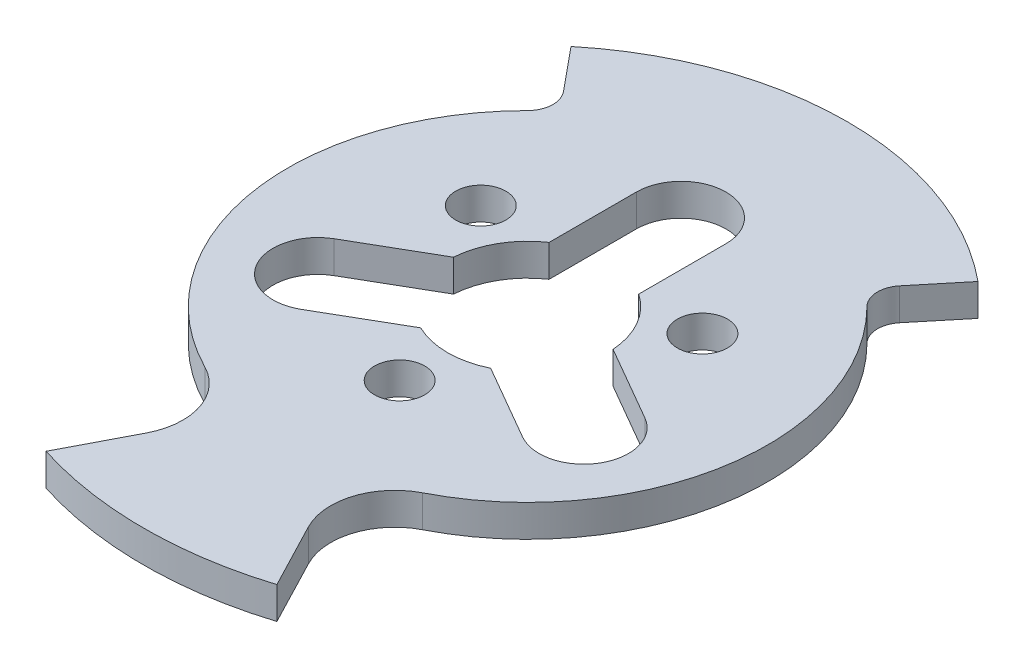
ISO-10303-21;
HEADER;
FILE_DESCRIPTION(('STEP AP214'),'2;1');
FILE_NAME('part.step','',(''),(''),'','','');
FILE_SCHEMA(('AUTOMOTIVE_DESIGN { 1 0 10303 214 1 1 1 1 }'));
ENDSEC;
DATA;
#1=APPLICATION_CONTEXT('core data for automotive mechanical design processes');
#2=APPLICATION_PROTOCOL_DEFINITION('international standard','automotive_design',2000,#1);
#3=PRODUCT_CONTEXT('',#1,'mechanical');
#4=PRODUCT('Part','Part','',(#3));
#5=PRODUCT_RELATED_PRODUCT_CATEGORY('part','',(#4));
#6=PRODUCT_DEFINITION_FORMATION('','',#4);
#7=PRODUCT_DEFINITION_CONTEXT('part definition',#1,'design');
#8=PRODUCT_DEFINITION('design','',#6,#7);
#9=PRODUCT_DEFINITION_SHAPE('','',#8);
#10=(LENGTH_UNIT() NAMED_UNIT(*) SI_UNIT(.MILLI.,.METRE.));
#11=(NAMED_UNIT(*) PLANE_ANGLE_UNIT() SI_UNIT($,.RADIAN.));
#12=(NAMED_UNIT(*) SI_UNIT($,.STERADIAN.) SOLID_ANGLE_UNIT());
#13=UNCERTAINTY_MEASURE_WITH_UNIT(LENGTH_MEASURE(1.E-05),#10,'distance_accuracy_value','');
#14=(GEOMETRIC_REPRESENTATION_CONTEXT(3) GLOBAL_UNCERTAINTY_ASSIGNED_CONTEXT((#13)) GLOBAL_UNIT_ASSIGNED_CONTEXT((#10,
#11,#12)) REPRESENTATION_CONTEXT('',''));
#15=CARTESIAN_POINT('',(0.,0.,0.));
#16=DIRECTION('',(0.,0.,1.));
#17=DIRECTION('',(1.,0.,0.));
#18=AXIS2_PLACEMENT_3D('',#15,#16,#17);
#19=CARTESIAN_POINT('',(0.,-38.1,0.));
#20=DIRECTION('',(0.,1.,0.));
#21=DIRECTION('',(0.,0.,1.));
#22=AXIS2_PLACEMENT_3D('',#19,#20,#21);
#23=CYLINDRICAL_SURFACE('',#22,23.8125);
#24=CARTESIAN_POINT('',(0.,-34.925,0.));
#25=DIRECTION('',(0.,-1.,0.));
#26=DIRECTION('',(0.,0.,-1.));
#27=AXIS2_PLACEMENT_3D('',#24,#25,#26);
#28=CIRCLE('',#27,23.8125);
#29=CARTESIAN_POINT('',(-10.8086921145059,-34.925,21.2180897119372));
#30=VERTEX_POINT('',#29);
#31=CARTESIAN_POINT('',(-16.8471089942339,-34.925,-16.8288465078984));
#32=VERTEX_POINT('',#31);
#33=EDGE_CURVE('E374',#30,#32,#28,.T.);
#34=ORIENTED_EDGE('',*,*,#33,.T.);
#35=DIRECTION('',(0.,1.,0.));
#36=VECTOR('',#35,1.);
#37=CARTESIAN_POINT('',(-16.8471089942339,-38.1,-16.8288465078984));
#38=LINE('',#37,#36);
#39=CARTESIAN_POINT('',(-16.8471089942339,-38.1,-16.8288465078984));
#40=VERTEX_POINT('',#39);
#41=EDGE_CURVE('E380',#32,#40,#38,.F.);
#42=ORIENTED_EDGE('',*,*,#41,.T.);
#43=CARTESIAN_POINT('',(0.,-38.1,0.));
#44=DIRECTION('',(0.,-1.,0.));
#45=DIRECTION('',(0.,0.,-1.));
#46=AXIS2_PLACEMENT_3D('',#43,#44,#45);
#47=CIRCLE('',#46,23.8125);
#48=CARTESIAN_POINT('',(-10.8086921145059,-38.1,21.2180897119372));
#49=VERTEX_POINT('',#48);
#50=EDGE_CURVE('E371',#49,#40,#47,.T.);
#51=ORIENTED_EDGE('',*,*,#50,.F.);
#52=DIRECTION('',(0.,-1.,0.));
#53=VECTOR('',#52,1.);
#54=CARTESIAN_POINT('',(-10.8086921145059,7.62308205651775,21.2180897119372));
#55=LINE('',#54,#53);
#56=EDGE_CURVE('E258',#30,#49,#55,.T.);
#57=ORIENTED_EDGE('',*,*,#56,.F.);
#58=EDGE_LOOP('',(#34,#42,#51,#57));
#59=FACE_BOUND('',#58,.T.);
#60=ADVANCED_FACE('F33',(#59),#23,.T.);
#61=CARTESIAN_POINT('',(0.,-38.1,0.));
#62=DIRECTION('',(0.,-1.,0.));
#63=DIRECTION('',(0.,0.,-1.));
#64=AXIS2_PLACEMENT_3D('',#61,#62,#63);
#65=PLANE('',#64);
#66=CARTESIAN_POINT('',(10.9985226280623,-38.1,-6.35000000000005));
#67=DIRECTION('',(0.,-1.,0.));
#68=DIRECTION('',(0.,0.,-1.));
#69=AXIS2_PLACEMENT_3D('',#66,#67,#68);
#70=CIRCLE('',#69,2.4892);
#71=CARTESIAN_POINT('',(10.9985226280623,-38.1,-8.83920000000005));
#72=VERTEX_POINT('',#71);
#73=EDGE_CURVE('E272',#72,#72,#70,.T.);
#74=ORIENTED_EDGE('',*,*,#73,.F.);
#75=EDGE_LOOP('',(#74));
#76=FACE_BOUND('',#75,.T.);
#77=DIRECTION('',(0.,0.,-1.));
#78=VECTOR('',#77,1.);
#79=CARTESIAN_POINT('',(-4.44500000000011,-38.1,-15.24));
#80=LINE('',#79,#78);
#81=CARTESIAN_POINT('',(-4.44500000000005,-38.1,-6.5761600687635));
#82=VERTEX_POINT('',#81);
#83=CARTESIAN_POINT('',(-4.44500000000011,-38.1,-15.24));
#84=VERTEX_POINT('',#83);
#85=EDGE_CURVE('E286',#82,#84,#80,.T.);
#86=ORIENTED_EDGE('',*,*,#85,.F.);
#87=CARTESIAN_POINT('',(0.,-38.1,0.));
#88=DIRECTION('',(0.,-1.,0.));
#89=DIRECTION('',(0.,0.,-1.));
#90=AXIS2_PLACEMENT_3D('',#87,#88,#89);
#91=CIRCLE('',#90,7.9375);
#92=CARTESIAN_POINT('',(-7.91762167890205,-38.1,-0.561402885439971));
#93=VERTEX_POINT('',#92);
#94=EDGE_CURVE('E284',#93,#82,#91,.T.);
#95=ORIENTED_EDGE('',*,*,#94,.F.);
#96=DIRECTION('',(0.866025403784433,0.,-0.50000000000001));
#97=VECTOR('',#96,1.);
#98=CARTESIAN_POINT('',(-7.91762167890205,-38.1,-0.561402885439971));
#99=LINE('',#98,#97);
#100=CARTESIAN_POINT('',(-15.4207271536748,-38.1,3.77051708017835));
#101=VERTEX_POINT('',#100);
#102=EDGE_CURVE('E308',#101,#93,#99,.T.);
#103=ORIENTED_EDGE('',*,*,#102,.F.);
#104=CARTESIAN_POINT('',(-13.1982271536748,-38.1,7.62000000000015));
#105=DIRECTION('',(0.,-1.,0.));
#106=DIRECTION('',(0.,0.,-1.));
#107=AXIS2_PLACEMENT_3D('',#104,#105,#106);
#108=CIRCLE('',#107,4.445);
#109=CARTESIAN_POINT('',(-10.9757271536747,-38.1,11.469482919822));
#110=VERTEX_POINT('',#109);
#111=EDGE_CURVE('E305',#110,#101,#108,.T.);
#112=ORIENTED_EDGE('',*,*,#111,.F.);
#113=DIRECTION('',(-0.866025403784433,0.,0.50000000000001));
#114=VECTOR('',#113,1.);
#115=CARTESIAN_POINT('',(-10.9757271536747,-38.1,11.469482919822));
#116=LINE('',#115,#114);
#117=CARTESIAN_POINT('',(-3.47262167890196,-38.1,7.13756295420364));
#118=VERTEX_POINT('',#117);
#119=EDGE_CURVE('E303',#118,#110,#116,.T.);
#120=ORIENTED_EDGE('',*,*,#119,.F.);
#121=CARTESIAN_POINT('',(0.,-38.1,0.));
#122=DIRECTION('',(0.,-1.,0.));
#123=DIRECTION('',(0.,0.,-1.));
#124=AXIS2_PLACEMENT_3D('',#121,#122,#123);
#125=CIRCLE('',#124,7.9375);
#126=CARTESIAN_POINT('',(3.47262167890206,-38.1,7.13756295420359));
#127=VERTEX_POINT('',#126);
#128=EDGE_CURVE('E301',#127,#118,#125,.T.);
#129=ORIENTED_EDGE('',*,*,#128,.F.);
#130=DIRECTION('',(-0.86602540378444,0.,-0.499999999999998));
#131=VECTOR('',#130,1.);
#132=CARTESIAN_POINT('',(3.47262167890206,-38.1,7.13756295420359));
#133=LINE('',#132,#131);
#134=CARTESIAN_POINT('',(10.9757271536749,-38.1,11.4694829198218));
#135=VERTEX_POINT('',#134);
#136=EDGE_CURVE('E299',#135,#127,#133,.T.);
#137=ORIENTED_EDGE('',*,*,#136,.F.);
#138=CARTESIAN_POINT('',(13.1982271536749,-38.1,7.61999999999997));
#139=DIRECTION('',(0.,-1.,0.));
#140=DIRECTION('',(0.,0.,-1.));
#141=AXIS2_PLACEMENT_3D('',#138,#139,#140);
#142=CIRCLE('',#141,4.445);
#143=CARTESIAN_POINT('',(15.4207271536749,-38.1,3.77051708017813));
#144=VERTEX_POINT('',#143);
#145=EDGE_CURVE('E297',#144,#135,#142,.T.);
#146=ORIENTED_EDGE('',*,*,#145,.F.);
#147=DIRECTION('',(0.86602540378444,0.,0.499999999999998));
#148=VECTOR('',#147,1.);
#149=CARTESIAN_POINT('',(15.4207271536749,-38.1,3.77051708017813));
#150=LINE('',#149,#148);
#151=CARTESIAN_POINT('',(7.91762167890204,-38.1,-0.561402885440083));
#152=VERTEX_POINT('',#151);
#153=EDGE_CURVE('E295',#152,#144,#150,.T.);
#154=ORIENTED_EDGE('',*,*,#153,.F.);
#155=CARTESIAN_POINT('',(0.,-38.1,0.));
#156=DIRECTION('',(0.,-1.,0.));
#157=DIRECTION('',(0.,0.,-1.));
#158=AXIS2_PLACEMENT_3D('',#155,#156,#157);
#159=CIRCLE('',#158,7.9375);
#160=CARTESIAN_POINT('',(4.44499999999995,-38.1,-6.57616006876356));
#161=VERTEX_POINT('',#160);
#162=EDGE_CURVE('E293',#161,#152,#159,.T.);
#163=ORIENTED_EDGE('',*,*,#162,.F.);
#164=DIRECTION('',(0.,0.,1.));
#165=VECTOR('',#164,1.);
#166=CARTESIAN_POINT('',(4.44499999999995,-38.1,-6.57616006876356));
#167=LINE('',#166,#165);
#168=CARTESIAN_POINT('',(4.4449999999999,-38.1,-15.24));
#169=VERTEX_POINT('',#168);
#170=EDGE_CURVE('E291',#169,#161,#167,.T.);
#171=ORIENTED_EDGE('',*,*,#170,.F.);
#172=CARTESIAN_POINT('',(-1.04950770296597E-13,-38.1,-15.24));
#173=DIRECTION('',(0.,-1.,0.));
#174=DIRECTION('',(0.,0.,-1.));
#175=AXIS2_PLACEMENT_3D('',#172,#173,#174);
#176=CIRCLE('',#175,4.445);
#177=EDGE_CURVE('E289',#84,#169,#176,.T.);
#178=ORIENTED_EDGE('',*,*,#177,.F.);
#179=EDGE_LOOP('',(#86,#95,#103,#112,#120,#129,#137,#146,#154,#163,#171,#178));
#180=FACE_BOUND('',#179,.T.);
#181=ORIENTED_EDGE('',*,*,#50,.T.);
#182=CARTESIAN_POINT('',(-18.6441339536189,-38.1,-18.6239234687408));
#183=DIRECTION('',(0.,-1.,0.));
#184=DIRECTION('',(0.,0.,-1.));
#185=AXIS2_PLACEMENT_3D('',#182,#183,#184);
#186=CIRCLE('',#185,2.54);
#187=CARTESIAN_POINT('',(-16.6842075118141,-38.1,-20.2395621482464));
#188=VERTEX_POINT('',#187);
#189=EDGE_CURVE('E41',#40,#188,#186,.F.);
#190=ORIENTED_EDGE('',*,*,#189,.T.);
#191=DIRECTION('',(-0.636078220277765,0.,-0.771624583387719));
#192=VECTOR('',#191,1.);
#193=CARTESIAN_POINT('',(-20.195483493819,-38.1,-24.4990805225601));
#194=LINE('',#193,#192);
#195=CARTESIAN_POINT('',(-20.195483493819,-38.1,-24.4990805225601));
#196=VERTEX_POINT('',#195);
#197=EDGE_CURVE('E204',#188,#196,#194,.T.);
#198=ORIENTED_EDGE('',*,*,#197,.T.);
#199=CARTESIAN_POINT('',(0.,-38.1,0.));
#200=DIRECTION('',(0.,-1.,0.));
#201=DIRECTION('',(0.,0.,-1.));
#202=AXIS2_PLACEMENT_3D('',#199,#200,#201);
#203=CIRCLE('',#202,31.75);
#204=CARTESIAN_POINT('',(20.195483493819,-38.1,-24.4990805225601));
#205=VERTEX_POINT('',#204);
#206=EDGE_CURVE('E199',#196,#205,#203,.T.);
#207=ORIENTED_EDGE('',*,*,#206,.T.);
#208=DIRECTION('',(-0.636078220277765,0.,0.771624583387719));
#209=VECTOR('',#208,1.);
#210=CARTESIAN_POINT('',(20.195483493819,-38.1,-24.4990805225601));
#211=LINE('',#210,#209);
#212=CARTESIAN_POINT('',(16.6842075118141,-38.1,-20.2395621482464));
#213=VERTEX_POINT('',#212);
#214=EDGE_CURVE('E208',#205,#213,#211,.T.);
#215=ORIENTED_EDGE('',*,*,#214,.T.);
#216=CARTESIAN_POINT('',(18.6441339536189,-38.1,-18.6239234687408));
#217=DIRECTION('',(0.,-1.,0.));
#218=DIRECTION('',(0.,0.,-1.));
#219=AXIS2_PLACEMENT_3D('',#216,#217,#218);
#220=CIRCLE('',#219,2.54);
#221=CARTESIAN_POINT('',(16.8471089942339,-38.1,-16.8288465078984));
#222=VERTEX_POINT('',#221);
#223=EDGE_CURVE('E384',#213,#222,#220,.F.);
#224=ORIENTED_EDGE('',*,*,#223,.T.);
#225=CARTESIAN_POINT('',(10.8086921145059,-38.1,21.2180897119372));
#226=VERTEX_POINT('',#225);
#227=EDGE_CURVE('E373',#222,#226,#47,.T.);
#228=ORIENTED_EDGE('',*,*,#227,.T.);
#229=CARTESIAN_POINT('',(13.6910100117075,-38.1,26.8762469684538));
#230=DIRECTION('',(0.,1.,0.));
#231=DIRECTION('',(0.,0.,-1.));
#232=AXIS2_PLACEMENT_3D('',#229,#230,#231);
#233=CIRCLE('',#232,6.35);
#234=CARTESIAN_POINT('',(8.05849122102583,-38.1,29.8083506624963));
#235=VERTEX_POINT('',#234);
#236=EDGE_CURVE('E245',#226,#235,#233,.T.);
#237=ORIENTED_EDGE('',*,*,#236,.T.);
#238=DIRECTION('',(0.461748613235035,0.,0.887010833178221));
#239=VECTOR('',#238,1.);
#240=CARTESIAN_POINT('',(11.4568909611131,-38.1,36.3366158235074));
#241=LINE('',#240,#239);
#242=CARTESIAN_POINT('',(11.4568909611131,-38.1,36.3366158235074));
#243=VERTEX_POINT('',#242);
#244=EDGE_CURVE('E248',#235,#243,#241,.T.);
#245=ORIENTED_EDGE('',*,*,#244,.T.);
#246=CARTESIAN_POINT('',(0.,-38.1,0.));
#247=DIRECTION('',(0.,-1.,0.));
#248=DIRECTION('',(0.,0.,1.));
#249=AXIS2_PLACEMENT_3D('',#246,#247,#248);
#250=CIRCLE('',#249,38.1);
#251=CARTESIAN_POINT('',(-11.4568909611131,-38.1,36.3366158235074));
#252=VERTEX_POINT('',#251);
#253=EDGE_CURVE('E225',#243,#252,#250,.T.);
#254=ORIENTED_EDGE('',*,*,#253,.T.);
#255=DIRECTION('',(0.461748613235035,0.,-0.887010833178221));
#256=VECTOR('',#255,1.);
#257=CARTESIAN_POINT('',(-11.4568909611131,-38.1,36.3366158235074));
#258=LINE('',#257,#256);
#259=CARTESIAN_POINT('',(-8.05849122102583,-38.1,29.8083506624963));
#260=VERTEX_POINT('',#259);
#261=EDGE_CURVE('E239',#252,#260,#258,.T.);
#262=ORIENTED_EDGE('',*,*,#261,.T.);
#263=CARTESIAN_POINT('',(-13.6910100117075,-38.1,26.8762469684538));
#264=DIRECTION('',(0.,1.,0.));
#265=DIRECTION('',(0.,0.,1.));
#266=AXIS2_PLACEMENT_3D('',#263,#264,#265);
#267=CIRCLE('',#266,6.35);
#268=EDGE_CURVE('E242',#260,#49,#267,.T.);
#269=ORIENTED_EDGE('',*,*,#268,.T.);
#270=EDGE_LOOP('',(#181,#190,#198,#207,#215,#224,#228,#237,#245,#254,#262,#269));
#271=FACE_BOUND('',#270,.T.);
#272=CARTESIAN_POINT('',(0.,-38.1,12.7));
#273=DIRECTION('',(0.,-1.,0.));
#274=DIRECTION('',(0.,0.,-1.));
#275=AXIS2_PLACEMENT_3D('',#272,#273,#274);
#276=CIRCLE('',#275,2.4892);
#277=CARTESIAN_POINT('',(0.,-38.1,10.2108));
#278=VERTEX_POINT('',#277);
#279=EDGE_CURVE('E278',#278,#278,#276,.T.);
#280=ORIENTED_EDGE('',*,*,#279,.F.);
#281=EDGE_LOOP('',(#280));
#282=FACE_BOUND('',#281,.T.);
#283=CARTESIAN_POINT('',(-10.9985226280624,-38.1,-6.3499999999999));
#284=DIRECTION('',(0.,-1.,0.));
#285=DIRECTION('',(0.,0.,-1.));
#286=AXIS2_PLACEMENT_3D('',#283,#284,#285);
#287=CIRCLE('',#286,2.4892);
#288=CARTESIAN_POINT('',(-10.9985226280624,-38.1,-8.8391999999999));
#289=VERTEX_POINT('',#288);
#290=EDGE_CURVE('E266',#289,#289,#287,.T.);
#291=ORIENTED_EDGE('',*,*,#290,.F.);
#292=EDGE_LOOP('',(#291));
#293=FACE_BOUND('',#292,.T.);
#294=ADVANCED_FACE('F213',(#76,#180,#271,#282,#293),#65,.T.);
#295=CARTESIAN_POINT('',(0.,-34.925,0.));
#296=DIRECTION('',(0.,-1.,0.));
#297=DIRECTION('',(0.,0.,-1.));
#298=AXIS2_PLACEMENT_3D('',#295,#296,#297);
#299=PLANE('',#298);
#300=ORIENTED_EDGE('',*,*,#33,.F.);
#301=CARTESIAN_POINT('',(-13.6910100117075,-34.925,26.8762469684538));
#302=DIRECTION('',(0.,-1.,0.));
#303=DIRECTION('',(0.,0.,-1.));
#304=AXIS2_PLACEMENT_3D('',#301,#302,#303);
#305=CIRCLE('',#304,6.35);
#306=CARTESIAN_POINT('',(-8.05849122102583,-34.925,29.8083506624963));
#307=VERTEX_POINT('',#306);
#308=EDGE_CURVE('E226',#30,#307,#305,.T.);
#309=ORIENTED_EDGE('',*,*,#308,.T.);
#310=DIRECTION('',(-0.461748613235035,0.,0.887010833178221));
#311=VECTOR('',#310,1.);
#312=CARTESIAN_POINT('',(-11.4568909611131,-34.925,36.3366158235074));
#313=LINE('',#312,#311);
#314=CARTESIAN_POINT('',(-11.4568909611131,-34.925,36.3366158235074));
#315=VERTEX_POINT('',#314);
#316=EDGE_CURVE('E236',#307,#315,#313,.T.);
#317=ORIENTED_EDGE('',*,*,#316,.T.);
#318=CARTESIAN_POINT('',(0.,-34.925,0.));
#319=DIRECTION('',(0.,-1.,0.));
#320=DIRECTION('',(0.,0.,-1.));
#321=AXIS2_PLACEMENT_3D('',#318,#319,#320);
#322=CIRCLE('',#321,38.1);
#323=CARTESIAN_POINT('',(11.4568909611131,-34.925,36.3366158235074));
#324=VERTEX_POINT('',#323);
#325=EDGE_CURVE('E234',#315,#324,#322,.F.);
#326=ORIENTED_EDGE('',*,*,#325,.T.);
#327=DIRECTION('',(-0.461748613235035,0.,-0.887010833178221));
#328=VECTOR('',#327,1.);
#329=CARTESIAN_POINT('',(11.4568909611131,-34.925,36.3366158235074));
#330=LINE('',#329,#328);
#331=CARTESIAN_POINT('',(8.05849122102582,-34.925,29.8083506624963));
#332=VERTEX_POINT('',#331);
#333=EDGE_CURVE('E232',#324,#332,#330,.T.);
#334=ORIENTED_EDGE('',*,*,#333,.T.);
#335=CARTESIAN_POINT('',(13.6910100117075,-34.925,26.8762469684538));
#336=DIRECTION('',(0.,-1.,0.));
#337=DIRECTION('',(0.,0.,-1.));
#338=AXIS2_PLACEMENT_3D('',#335,#336,#337);
#339=CIRCLE('',#338,6.35);
#340=CARTESIAN_POINT('',(10.8086921145059,-34.925,21.2180897119372));
#341=VERTEX_POINT('',#340);
#342=EDGE_CURVE('E228',#332,#341,#339,.T.);
#343=ORIENTED_EDGE('',*,*,#342,.T.);
#344=CARTESIAN_POINT('',(16.8471089942339,-34.925,-16.8288465078984));
#345=VERTEX_POINT('',#344);
#346=EDGE_CURVE('E370',#345,#341,#28,.T.);
#347=ORIENTED_EDGE('',*,*,#346,.F.);
#348=CARTESIAN_POINT('',(18.6441339536189,-34.925,-18.6239234687408));
#349=DIRECTION('',(0.,-1.,0.));
#350=DIRECTION('',(0.,0.,-1.));
#351=AXIS2_PLACEMENT_3D('',#348,#349,#350);
#352=CIRCLE('',#351,2.54);
#353=CARTESIAN_POINT('',(16.6842075118141,-34.925,-20.2395621482464));
#354=VERTEX_POINT('',#353);
#355=EDGE_CURVE('E386',#345,#354,#352,.T.);
#356=ORIENTED_EDGE('',*,*,#355,.T.);
#357=DIRECTION('',(0.636078220277765,0.,-0.77162458338772));
#358=VECTOR('',#357,1.);
#359=CARTESIAN_POINT('',(20.195483493819,-34.925,-24.4990805225601));
#360=LINE('',#359,#358);
#361=CARTESIAN_POINT('',(20.195483493819,-34.925,-24.4990805225601));
#362=VERTEX_POINT('',#361);
#363=EDGE_CURVE('E223',#354,#362,#360,.T.);
#364=ORIENTED_EDGE('',*,*,#363,.T.);
#365=CARTESIAN_POINT('',(0.,-34.925,0.));
#366=DIRECTION('',(0.,-1.,0.));
#367=DIRECTION('',(0.,0.,-1.));
#368=AXIS2_PLACEMENT_3D('',#365,#366,#367);
#369=CIRCLE('',#368,31.75);
#370=CARTESIAN_POINT('',(-20.195483493819,-34.925,-24.4990805225601));
#371=VERTEX_POINT('',#370);
#372=EDGE_CURVE('E200',#362,#371,#369,.F.);
#373=ORIENTED_EDGE('',*,*,#372,.T.);
#374=DIRECTION('',(0.636078220277765,0.,0.77162458338772));
#375=VECTOR('',#374,1.);
#376=CARTESIAN_POINT('',(-20.195483493819,-34.925,-24.4990805225601));
#377=LINE('',#376,#375);
#378=CARTESIAN_POINT('',(-16.6842075118141,-34.925,-20.2395621482464));
#379=VERTEX_POINT('',#378);
#380=EDGE_CURVE('E221',#371,#379,#377,.T.);
#381=ORIENTED_EDGE('',*,*,#380,.T.);
#382=CARTESIAN_POINT('',(-18.6441339536189,-34.925,-18.6239234687408));
#383=DIRECTION('',(0.,-1.,0.));
#384=DIRECTION('',(0.,0.,-1.));
#385=AXIS2_PLACEMENT_3D('',#382,#383,#384);
#386=CIRCLE('',#385,2.54);
#387=EDGE_CURVE('E11',#379,#32,#386,.T.);
#388=ORIENTED_EDGE('',*,*,#387,.T.);
#389=EDGE_LOOP('',(#300,#309,#317,#326,#334,#343,#347,#356,#364,#373,#381,#388));
#390=FACE_BOUND('',#389,.T.);
#391=CARTESIAN_POINT('',(0.,-34.925,0.));
#392=DIRECTION('',(0.,-1.,0.));
#393=DIRECTION('',(0.,0.,-1.));
#394=AXIS2_PLACEMENT_3D('',#391,#392,#393);
#395=CIRCLE('',#394,7.9375);
#396=CARTESIAN_POINT('',(-7.91762167890205,-34.925,-0.561402885439971));
#397=VERTEX_POINT('',#396);
#398=CARTESIAN_POINT('',(-4.44500000000005,-34.925,-6.5761600687635));
#399=VERTEX_POINT('',#398);
#400=EDGE_CURVE('E281',#397,#399,#395,.T.);
#401=ORIENTED_EDGE('',*,*,#400,.T.);
#402=DIRECTION('',(0.,0.,-1.));
#403=VECTOR('',#402,1.);
#404=CARTESIAN_POINT('',(-4.44500000000011,-34.925,-15.24));
#405=LINE('',#404,#403);
#406=CARTESIAN_POINT('',(-4.44500000000011,-34.925,-15.24));
#407=VERTEX_POINT('',#406);
#408=EDGE_CURVE('E313',#399,#407,#405,.T.);
#409=ORIENTED_EDGE('',*,*,#408,.T.);
#410=CARTESIAN_POINT('',(-1.04950770296597E-13,-34.925,-15.24));
#411=DIRECTION('',(0.,-1.,0.));
#412=DIRECTION('',(0.,0.,-1.));
#413=AXIS2_PLACEMENT_3D('',#410,#411,#412);
#414=CIRCLE('',#413,4.445);
#415=CARTESIAN_POINT('',(4.4449999999999,-34.925,-15.24));
#416=VERTEX_POINT('',#415);
#417=EDGE_CURVE('E316',#407,#416,#414,.T.);
#418=ORIENTED_EDGE('',*,*,#417,.T.);
#419=DIRECTION('',(0.,0.,1.));
#420=VECTOR('',#419,1.);
#421=CARTESIAN_POINT('',(4.44499999999995,-34.925,-6.57616006876356));
#422=LINE('',#421,#420);
#423=CARTESIAN_POINT('',(4.44499999999995,-34.925,-6.57616006876356));
#424=VERTEX_POINT('',#423);
#425=EDGE_CURVE('E319',#416,#424,#422,.T.);
#426=ORIENTED_EDGE('',*,*,#425,.T.);
#427=CARTESIAN_POINT('',(0.,-34.925,0.));
#428=DIRECTION('',(0.,-1.,0.));
#429=DIRECTION('',(0.,0.,-1.));
#430=AXIS2_PLACEMENT_3D('',#427,#428,#429);
#431=CIRCLE('',#430,7.9375);
#432=CARTESIAN_POINT('',(7.91762167890204,-34.925,-0.561402885440083));
#433=VERTEX_POINT('',#432);
#434=EDGE_CURVE('E322',#424,#433,#431,.T.);
#435=ORIENTED_EDGE('',*,*,#434,.T.);
#436=DIRECTION('',(0.86602540378444,0.,0.499999999999998));
#437=VECTOR('',#436,1.);
#438=CARTESIAN_POINT('',(15.4207271536749,-34.925,3.77051708017813));
#439=LINE('',#438,#437);
#440=CARTESIAN_POINT('',(15.4207271536749,-34.925,3.77051708017813));
#441=VERTEX_POINT('',#440);
#442=EDGE_CURVE('E325',#433,#441,#439,.T.);
#443=ORIENTED_EDGE('',*,*,#442,.T.);
#444=CARTESIAN_POINT('',(13.1982271536749,-34.925,7.61999999999997));
#445=DIRECTION('',(0.,-1.,0.));
#446=DIRECTION('',(0.,0.,-1.));
#447=AXIS2_PLACEMENT_3D('',#444,#445,#446);
#448=CIRCLE('',#447,4.445);
#449=CARTESIAN_POINT('',(10.9757271536749,-34.925,11.4694829198218));
#450=VERTEX_POINT('',#449);
#451=EDGE_CURVE('E328',#441,#450,#448,.T.);
#452=ORIENTED_EDGE('',*,*,#451,.T.);
#453=DIRECTION('',(-0.86602540378444,0.,-0.499999999999998));
#454=VECTOR('',#453,1.);
#455=CARTESIAN_POINT('',(3.47262167890206,-34.925,7.13756295420359));
#456=LINE('',#455,#454);
#457=CARTESIAN_POINT('',(3.47262167890206,-34.925,7.13756295420359));
#458=VERTEX_POINT('',#457);
#459=EDGE_CURVE('E331',#450,#458,#456,.T.);
#460=ORIENTED_EDGE('',*,*,#459,.T.);
#461=CARTESIAN_POINT('',(0.,-34.925,0.));
#462=DIRECTION('',(0.,-1.,0.));
#463=DIRECTION('',(0.,0.,-1.));
#464=AXIS2_PLACEMENT_3D('',#461,#462,#463);
#465=CIRCLE('',#464,7.9375);
#466=CARTESIAN_POINT('',(-3.47262167890196,-34.925,7.13756295420364));
#467=VERTEX_POINT('',#466);
#468=EDGE_CURVE('E334',#458,#467,#465,.T.);
#469=ORIENTED_EDGE('',*,*,#468,.T.);
#470=DIRECTION('',(-0.866025403784433,0.,0.50000000000001));
#471=VECTOR('',#470,1.);
#472=CARTESIAN_POINT('',(-10.9757271536747,-34.925,11.469482919822));
#473=LINE('',#472,#471);
#474=CARTESIAN_POINT('',(-10.9757271536747,-34.925,11.469482919822));
#475=VERTEX_POINT('',#474);
#476=EDGE_CURVE('E337',#467,#475,#473,.T.);
#477=ORIENTED_EDGE('',*,*,#476,.T.);
#478=CARTESIAN_POINT('',(-13.1982271536748,-34.925,7.62000000000015));
#479=DIRECTION('',(0.,-1.,0.));
#480=DIRECTION('',(0.,0.,-1.));
#481=AXIS2_PLACEMENT_3D('',#478,#479,#480);
#482=CIRCLE('',#481,4.445);
#483=CARTESIAN_POINT('',(-15.4207271536748,-34.925,3.77051708017835));
#484=VERTEX_POINT('',#483);
#485=EDGE_CURVE('E340',#475,#484,#482,.T.);
#486=ORIENTED_EDGE('',*,*,#485,.T.);
#487=DIRECTION('',(0.866025403784433,0.,-0.50000000000001));
#488=VECTOR('',#487,1.);
#489=CARTESIAN_POINT('',(-7.91762167890205,-34.925,-0.561402885439971));
#490=LINE('',#489,#488);
#491=EDGE_CURVE('E287',#484,#397,#490,.T.);
#492=ORIENTED_EDGE('',*,*,#491,.T.);
#493=EDGE_LOOP('',(#401,#409,#418,#426,#435,#443,#452,#460,#469,#477,#486,#492));
#494=FACE_BOUND('',#493,.T.);
#495=CARTESIAN_POINT('',(0.,-34.925,12.7));
#496=DIRECTION('',(0.,-1.,0.));
#497=DIRECTION('',(0.,0.,-1.));
#498=AXIS2_PLACEMENT_3D('',#495,#496,#497);
#499=CIRCLE('',#498,2.4892);
#500=CARTESIAN_POINT('',(0.,-34.925,10.2108));
#501=VERTEX_POINT('',#500);
#502=EDGE_CURVE('E275',#501,#501,#499,.T.);
#503=ORIENTED_EDGE('',*,*,#502,.T.);
#504=EDGE_LOOP('',(#503));
#505=FACE_BOUND('',#504,.T.);
#506=CARTESIAN_POINT('',(10.9985226280623,-34.925,-6.35000000000005));
#507=DIRECTION('',(0.,-1.,0.));
#508=DIRECTION('',(0.,0.,-1.));
#509=AXIS2_PLACEMENT_3D('',#506,#507,#508);
#510=CIRCLE('',#509,2.4892);
#511=CARTESIAN_POINT('',(10.9985226280623,-34.925,-8.83920000000005));
#512=VERTEX_POINT('',#511);
#513=EDGE_CURVE('E269',#512,#512,#510,.T.);
#514=ORIENTED_EDGE('',*,*,#513,.T.);
#515=EDGE_LOOP('',(#514));
#516=FACE_BOUND('',#515,.T.);
#517=CARTESIAN_POINT('',(-10.9985226280624,-34.925,-6.3499999999999));
#518=DIRECTION('',(0.,-1.,0.));
#519=DIRECTION('',(0.,0.,-1.));
#520=AXIS2_PLACEMENT_3D('',#517,#518,#519);
#521=CIRCLE('',#520,2.4892);
#522=CARTESIAN_POINT('',(-10.9985226280624,-34.925,-8.8391999999999));
#523=VERTEX_POINT('',#522);
#524=EDGE_CURVE('E265',#523,#523,#521,.T.);
#525=ORIENTED_EDGE('',*,*,#524,.T.);
#526=EDGE_LOOP('',(#525));
#527=FACE_BOUND('',#526,.T.);
#528=ADVANCED_FACE('F390',(#390,#494,#505,#516,#527),#299,.F.);
#529=ORIENTED_EDGE('',*,*,#227,.F.);
#530=DIRECTION('',(0.,1.,0.));
#531=VECTOR('',#530,1.);
#532=CARTESIAN_POINT('',(16.8471089942339,-38.1,-16.8288465078984));
#533=LINE('',#532,#531);
#534=EDGE_CURVE('E378',#222,#345,#533,.T.);
#535=ORIENTED_EDGE('',*,*,#534,.T.);
#536=ORIENTED_EDGE('',*,*,#346,.T.);
#537=DIRECTION('',(0.,-1.,0.));
#538=VECTOR('',#537,1.);
#539=CARTESIAN_POINT('',(10.8086921145059,7.62308205651775,21.2180897119372));
#540=LINE('',#539,#538);
#541=EDGE_CURVE('E255',#341,#226,#540,.T.);
#542=ORIENTED_EDGE('',*,*,#541,.T.);
#543=EDGE_LOOP('',(#529,#535,#536,#542));
#544=FACE_BOUND('',#543,.T.);
#545=ADVANCED_FACE('F397',(#544),#23,.T.);
#546=CARTESIAN_POINT('',(0.,-38.1,0.));
#547=DIRECTION('',(0.,1.,0.));
#548=DIRECTION('',(0.,0.,1.));
#549=AXIS2_PLACEMENT_3D('',#546,#547,#548);
#550=CYLINDRICAL_SURFACE('',#549,7.9375);
#551=ORIENTED_EDGE('',*,*,#400,.F.);
#552=DIRECTION('',(0.,1.,0.));
#553=VECTOR('',#552,1.);
#554=CARTESIAN_POINT('',(-7.91762167890205,-38.1,-0.561402885439971));
#555=LINE('',#554,#553);
#556=EDGE_CURVE('E310',#93,#397,#555,.T.);
#557=ORIENTED_EDGE('',*,*,#556,.F.);
#558=ORIENTED_EDGE('',*,*,#94,.T.);
#559=DIRECTION('',(0.,1.,0.));
#560=VECTOR('',#559,1.);
#561=CARTESIAN_POINT('',(-4.44500000000005,-38.1,-6.5761600687635));
#562=LINE('',#561,#560);
#563=EDGE_CURVE('E368',#82,#399,#562,.T.);
#564=ORIENTED_EDGE('',*,*,#563,.T.);
#565=EDGE_LOOP('',(#551,#557,#558,#564));
#566=FACE_BOUND('',#565,.T.);
#567=ADVANCED_FACE('F446',(#566),#550,.F.);
#568=CARTESIAN_POINT('',(-4.44500000000011,-38.1,-15.24));
#569=DIRECTION('',(1.,0.,0.));
#570=DIRECTION('',(0.,0.,-1.));
#571=AXIS2_PLACEMENT_3D('',#568,#569,#570);
#572=PLANE('',#571);
#573=ORIENTED_EDGE('',*,*,#408,.F.);
#574=ORIENTED_EDGE('',*,*,#563,.F.);
#575=ORIENTED_EDGE('',*,*,#85,.T.);
#576=DIRECTION('',(0.,1.,0.));
#577=VECTOR('',#576,1.);
#578=CARTESIAN_POINT('',(-4.44500000000011,-38.1,-15.24));
#579=LINE('',#578,#577);
#580=EDGE_CURVE('E366',#84,#407,#579,.T.);
#581=ORIENTED_EDGE('',*,*,#580,.T.);
#582=EDGE_LOOP('',(#573,#574,#575,#581));
#583=FACE_BOUND('',#582,.T.);
#584=ADVANCED_FACE('F451',(#583),#572,.T.);
#585=CARTESIAN_POINT('',(-1.04950770296597E-13,-38.1,-15.24));
#586=DIRECTION('',(0.,1.,0.));
#587=DIRECTION('',(0.,0.,1.));
#588=AXIS2_PLACEMENT_3D('',#585,#586,#587);
#589=CYLINDRICAL_SURFACE('',#588,4.445);
#590=ORIENTED_EDGE('',*,*,#417,.F.);
#591=ORIENTED_EDGE('',*,*,#580,.F.);
#592=ORIENTED_EDGE('',*,*,#177,.T.);
#593=DIRECTION('',(0.,1.,0.));
#594=VECTOR('',#593,1.);
#595=CARTESIAN_POINT('',(4.4449999999999,-38.1,-15.24));
#596=LINE('',#595,#594);
#597=EDGE_CURVE('E364',#169,#416,#596,.T.);
#598=ORIENTED_EDGE('',*,*,#597,.T.);
#599=EDGE_LOOP('',(#590,#591,#592,#598));
#600=FACE_BOUND('',#599,.T.);
#601=ADVANCED_FACE('F459',(#600),#589,.F.);
#602=CARTESIAN_POINT('',(4.44499999999995,-38.1,-6.57616006876356));
#603=DIRECTION('',(-1.,0.,0.));
#604=DIRECTION('',(0.,0.,1.));
#605=AXIS2_PLACEMENT_3D('',#602,#603,#604);
#606=PLANE('',#605);
#607=ORIENTED_EDGE('',*,*,#425,.F.);
#608=ORIENTED_EDGE('',*,*,#597,.F.);
#609=ORIENTED_EDGE('',*,*,#170,.T.);
#610=DIRECTION('',(0.,1.,0.));
#611=VECTOR('',#610,1.);
#612=CARTESIAN_POINT('',(4.44499999999995,-38.1,-6.57616006876356));
#613=LINE('',#612,#611);
#614=EDGE_CURVE('E361',#161,#424,#613,.T.);
#615=ORIENTED_EDGE('',*,*,#614,.T.);
#616=EDGE_LOOP('',(#607,#608,#609,#615));
#617=FACE_BOUND('',#616,.T.);
#618=ADVANCED_FACE('F463',(#617),#606,.T.);
#619=CARTESIAN_POINT('',(0.,-38.1,0.));
#620=DIRECTION('',(0.,1.,0.));
#621=DIRECTION('',(0.,0.,1.));
#622=AXIS2_PLACEMENT_3D('',#619,#620,#621);
#623=CYLINDRICAL_SURFACE('',#622,7.9375);
#624=ORIENTED_EDGE('',*,*,#434,.F.);
#625=ORIENTED_EDGE('',*,*,#614,.F.);
#626=ORIENTED_EDGE('',*,*,#162,.T.);
#627=DIRECTION('',(0.,1.,0.));
#628=VECTOR('',#627,1.);
#629=CARTESIAN_POINT('',(7.91762167890204,-38.1,-0.561402885440083));
#630=LINE('',#629,#628);
#631=EDGE_CURVE('E359',#152,#433,#630,.T.);
#632=ORIENTED_EDGE('',*,*,#631,.T.);
#633=EDGE_LOOP('',(#624,#625,#626,#632));
#634=FACE_BOUND('',#633,.T.);
#635=ADVANCED_FACE('F467',(#634),#623,.F.);
#636=CARTESIAN_POINT('',(15.4207271536749,-38.1,3.77051708017813));
#637=DIRECTION('',(-0.499999999999998,0.,0.86602540378444));
#638=DIRECTION('',(0.86602540378444,0.,0.499999999999998));
#639=AXIS2_PLACEMENT_3D('',#636,#637,#638);
#640=PLANE('',#639);
#641=ORIENTED_EDGE('',*,*,#442,.F.);
#642=ORIENTED_EDGE('',*,*,#631,.F.);
#643=ORIENTED_EDGE('',*,*,#153,.T.);
#644=DIRECTION('',(0.,1.,0.));
#645=VECTOR('',#644,1.);
#646=CARTESIAN_POINT('',(15.4207271536749,-38.1,3.77051708017813));
#647=LINE('',#646,#645);
#648=EDGE_CURVE('E357',#144,#441,#647,.T.);
#649=ORIENTED_EDGE('',*,*,#648,.T.);
#650=EDGE_LOOP('',(#641,#642,#643,#649));
#651=FACE_BOUND('',#650,.T.);
#652=ADVANCED_FACE('F471',(#651),#640,.T.);
#653=CARTESIAN_POINT('',(13.1982271536749,-38.1,7.61999999999997));
#654=DIRECTION('',(0.,1.,0.));
#655=DIRECTION('',(0.,0.,1.));
#656=AXIS2_PLACEMENT_3D('',#653,#654,#655);
#657=CYLINDRICAL_SURFACE('',#656,4.445);
#658=ORIENTED_EDGE('',*,*,#451,.F.);
#659=ORIENTED_EDGE('',*,*,#648,.F.);
#660=ORIENTED_EDGE('',*,*,#145,.T.);
#661=DIRECTION('',(0.,1.,0.));
#662=VECTOR('',#661,1.);
#663=CARTESIAN_POINT('',(10.9757271536749,-38.1,11.4694829198218));
#664=LINE('',#663,#662);
#665=EDGE_CURVE('E355',#135,#450,#664,.T.);
#666=ORIENTED_EDGE('',*,*,#665,.T.);
#667=EDGE_LOOP('',(#658,#659,#660,#666));
#668=FACE_BOUND('',#667,.T.);
#669=ADVANCED_FACE('F475',(#668),#657,.F.);
#670=CARTESIAN_POINT('',(3.47262167890206,-38.1,7.13756295420359));
#671=DIRECTION('',(0.499999999999998,0.,-0.86602540378444));
#672=DIRECTION('',(-0.86602540378444,0.,-0.499999999999998));
#673=AXIS2_PLACEMENT_3D('',#670,#671,#672);
#674=PLANE('',#673);
#675=ORIENTED_EDGE('',*,*,#459,.F.);
#676=ORIENTED_EDGE('',*,*,#665,.F.);
#677=ORIENTED_EDGE('',*,*,#136,.T.);
#678=DIRECTION('',(0.,1.,0.));
#679=VECTOR('',#678,1.);
#680=CARTESIAN_POINT('',(3.47262167890206,-38.1,7.13756295420359));
#681=LINE('',#680,#679);
#682=EDGE_CURVE('E352',#127,#458,#681,.T.);
#683=ORIENTED_EDGE('',*,*,#682,.T.);
#684=EDGE_LOOP('',(#675,#676,#677,#683));
#685=FACE_BOUND('',#684,.T.);
#686=ADVANCED_FACE('F479',(#685),#674,.T.);
#687=CARTESIAN_POINT('',(0.,-38.1,0.));
#688=DIRECTION('',(0.,1.,0.));
#689=DIRECTION('',(0.,0.,1.));
#690=AXIS2_PLACEMENT_3D('',#687,#688,#689);
#691=CYLINDRICAL_SURFACE('',#690,7.9375);
#692=ORIENTED_EDGE('',*,*,#468,.F.);
#693=ORIENTED_EDGE('',*,*,#682,.F.);
#694=ORIENTED_EDGE('',*,*,#128,.T.);
#695=DIRECTION('',(0.,1.,0.));
#696=VECTOR('',#695,1.);
#697=CARTESIAN_POINT('',(-3.47262167890196,-38.1,7.13756295420364));
#698=LINE('',#697,#696);
#699=EDGE_CURVE('E350',#118,#467,#698,.T.);
#700=ORIENTED_EDGE('',*,*,#699,.T.);
#701=EDGE_LOOP('',(#692,#693,#694,#700));
#702=FACE_BOUND('',#701,.T.);
#703=ADVANCED_FACE('F483',(#702),#691,.F.);
#704=CARTESIAN_POINT('',(-10.9757271536747,-38.1,11.469482919822));
#705=DIRECTION('',(-0.50000000000001,0.,-0.866025403784433));
#706=DIRECTION('',(-0.866025403784433,0.,0.50000000000001));
#707=AXIS2_PLACEMENT_3D('',#704,#705,#706);
#708=PLANE('',#707);
#709=ORIENTED_EDGE('',*,*,#476,.F.);
#710=ORIENTED_EDGE('',*,*,#699,.F.);
#711=ORIENTED_EDGE('',*,*,#119,.T.);
#712=DIRECTION('',(0.,1.,0.));
#713=VECTOR('',#712,1.);
#714=CARTESIAN_POINT('',(-10.9757271536747,-38.1,11.469482919822));
#715=LINE('',#714,#713);
#716=EDGE_CURVE('E348',#110,#475,#715,.T.);
#717=ORIENTED_EDGE('',*,*,#716,.T.);
#718=EDGE_LOOP('',(#709,#710,#711,#717));
#719=FACE_BOUND('',#718,.T.);
#720=ADVANCED_FACE('F487',(#719),#708,.T.);
#721=CARTESIAN_POINT('',(-13.1982271536748,-38.1,7.62000000000015));
#722=DIRECTION('',(0.,1.,0.));
#723=DIRECTION('',(0.,0.,1.));
#724=AXIS2_PLACEMENT_3D('',#721,#722,#723);
#725=CYLINDRICAL_SURFACE('',#724,4.445);
#726=ORIENTED_EDGE('',*,*,#485,.F.);
#727=ORIENTED_EDGE('',*,*,#716,.F.);
#728=ORIENTED_EDGE('',*,*,#111,.T.);
#729=DIRECTION('',(0.,1.,0.));
#730=VECTOR('',#729,1.);
#731=CARTESIAN_POINT('',(-15.4207271536748,-38.1,3.77051708017835));
#732=LINE('',#731,#730);
#733=EDGE_CURVE('E346',#101,#484,#732,.T.);
#734=ORIENTED_EDGE('',*,*,#733,.T.);
#735=EDGE_LOOP('',(#726,#727,#728,#734));
#736=FACE_BOUND('',#735,.T.);
#737=ADVANCED_FACE('F491',(#736),#725,.F.);
#738=CARTESIAN_POINT('',(-7.91762167890205,-38.1,-0.561402885439971));
#739=DIRECTION('',(0.50000000000001,0.,0.866025403784433));
#740=DIRECTION('',(0.866025403784433,0.,-0.50000000000001));
#741=AXIS2_PLACEMENT_3D('',#738,#739,#740);
#742=PLANE('',#741);
#743=ORIENTED_EDGE('',*,*,#491,.F.);
#744=ORIENTED_EDGE('',*,*,#733,.F.);
#745=ORIENTED_EDGE('',*,*,#102,.T.);
#746=ORIENTED_EDGE('',*,*,#556,.T.);
#747=EDGE_LOOP('',(#743,#744,#745,#746));
#748=FACE_BOUND('',#747,.T.);
#749=ADVANCED_FACE('F495',(#748),#742,.T.);
#750=CARTESIAN_POINT('',(0.,-38.1,12.7));
#751=DIRECTION('',(0.,1.,0.));
#752=DIRECTION('',(0.,0.,1.));
#753=AXIS2_PLACEMENT_3D('',#750,#751,#752);
#754=CYLINDRICAL_SURFACE('',#753,2.4892);
#755=ORIENTED_EDGE('',*,*,#279,.T.);
#756=EDGE_LOOP('',(#755));
#757=FACE_BOUND('',#756,.T.);
#758=ORIENTED_EDGE('',*,*,#502,.F.);
#759=EDGE_LOOP('',(#758));
#760=FACE_BOUND('',#759,.T.);
#761=ADVANCED_FACE('F499',(#757,#760),#754,.F.);
#762=CARTESIAN_POINT('',(10.9985226280623,-38.1,-6.35000000000005));
#763=DIRECTION('',(0.,1.,0.));
#764=DIRECTION('',(0.,0.,1.));
#765=AXIS2_PLACEMENT_3D('',#762,#763,#764);
#766=CYLINDRICAL_SURFACE('',#765,2.4892);
#767=ORIENTED_EDGE('',*,*,#73,.T.);
#768=EDGE_LOOP('',(#767));
#769=FACE_BOUND('',#768,.T.);
#770=ORIENTED_EDGE('',*,*,#513,.F.);
#771=EDGE_LOOP('',(#770));
#772=FACE_BOUND('',#771,.T.);
#773=ADVANCED_FACE('F503',(#769,#772),#766,.F.);
#774=CARTESIAN_POINT('',(-10.9985226280624,-38.1,-6.3499999999999));
#775=DIRECTION('',(0.,1.,0.));
#776=DIRECTION('',(0.,0.,1.));
#777=AXIS2_PLACEMENT_3D('',#774,#775,#776);
#778=CYLINDRICAL_SURFACE('',#777,2.4892);
#779=ORIENTED_EDGE('',*,*,#290,.T.);
#780=EDGE_LOOP('',(#779));
#781=FACE_BOUND('',#780,.T.);
#782=ORIENTED_EDGE('',*,*,#524,.F.);
#783=EDGE_LOOP('',(#782));
#784=FACE_BOUND('',#783,.T.);
#785=ADVANCED_FACE('F507',(#781,#784),#778,.F.);
#786=CARTESIAN_POINT('',(0.,7.62308205651775,0.));
#787=DIRECTION('',(0.,-1.,0.));
#788=DIRECTION('',(0.,0.,-1.));
#789=AXIS2_PLACEMENT_3D('',#786,#787,#788);
#790=CYLINDRICAL_SURFACE('',#789,38.1);
#791=ORIENTED_EDGE('',*,*,#325,.F.);
#792=DIRECTION('',(0.,-1.,0.));
#793=VECTOR('',#792,1.);
#794=CARTESIAN_POINT('',(-11.4568909611131,7.62308205651775,36.3366158235074));
#795=LINE('',#794,#793);
#796=EDGE_CURVE('E251',#315,#252,#795,.T.);
#797=ORIENTED_EDGE('',*,*,#796,.T.);
#798=ORIENTED_EDGE('',*,*,#253,.F.);
#799=DIRECTION('',(0.,-1.,0.));
#800=VECTOR('',#799,1.);
#801=CARTESIAN_POINT('',(11.4568909611131,7.62308205651775,36.3366158235074));
#802=LINE('',#801,#800);
#803=EDGE_CURVE('E229',#324,#243,#802,.T.);
#804=ORIENTED_EDGE('',*,*,#803,.F.);
#805=EDGE_LOOP('',(#791,#797,#798,#804));
#806=FACE_BOUND('',#805,.T.);
#807=ADVANCED_FACE('F412',(#806),#790,.T.);
#808=CARTESIAN_POINT('',(11.4568909611131,7.62308205651775,36.3366158235074));
#809=DIRECTION('',(0.887010833178221,0.,-0.461748613235035));
#810=DIRECTION('',(-0.461748613235035,0.,-0.887010833178221));
#811=AXIS2_PLACEMENT_3D('',#808,#809,#810);
#812=PLANE('',#811);
#813=ORIENTED_EDGE('',*,*,#333,.F.);
#814=ORIENTED_EDGE('',*,*,#803,.T.);
#815=ORIENTED_EDGE('',*,*,#244,.F.);
#816=DIRECTION('',(0.,-1.,0.));
#817=VECTOR('',#816,1.);
#818=CARTESIAN_POINT('',(8.05849122102583,7.62308205651775,29.8083506624963));
#819=LINE('',#818,#817);
#820=EDGE_CURVE('E253',#332,#235,#819,.T.);
#821=ORIENTED_EDGE('',*,*,#820,.F.);
#822=EDGE_LOOP('',(#813,#814,#815,#821));
#823=FACE_BOUND('',#822,.T.);
#824=ADVANCED_FACE('F407',(#823),#812,.T.);
#825=CARTESIAN_POINT('',(13.6910100117075,7.62308205651775,26.8762469684538));
#826=DIRECTION('',(0.,-1.,0.));
#827=DIRECTION('',(0.,0.,-1.));
#828=AXIS2_PLACEMENT_3D('',#825,#826,#827);
#829=CYLINDRICAL_SURFACE('',#828,6.35);
#830=ORIENTED_EDGE('',*,*,#342,.F.);
#831=ORIENTED_EDGE('',*,*,#820,.T.);
#832=ORIENTED_EDGE('',*,*,#236,.F.);
#833=ORIENTED_EDGE('',*,*,#541,.F.);
#834=EDGE_LOOP('',(#830,#831,#832,#833));
#835=FACE_BOUND('',#834,.T.);
#836=ADVANCED_FACE('F402',(#835),#829,.F.);
#837=CARTESIAN_POINT('',(-13.6910100117075,7.62308205651775,26.8762469684538));
#838=DIRECTION('',(0.,-1.,0.));
#839=DIRECTION('',(0.,0.,-1.));
#840=AXIS2_PLACEMENT_3D('',#837,#838,#839);
#841=CYLINDRICAL_SURFACE('',#840,6.35);
#842=ORIENTED_EDGE('',*,*,#308,.F.);
#843=ORIENTED_EDGE('',*,*,#56,.T.);
#844=ORIENTED_EDGE('',*,*,#268,.F.);
#845=DIRECTION('',(0.,-1.,0.));
#846=VECTOR('',#845,1.);
#847=CARTESIAN_POINT('',(-8.05849122102583,7.62308205651775,29.8083506624963));
#848=LINE('',#847,#846);
#849=EDGE_CURVE('E261',#307,#260,#848,.T.);
#850=ORIENTED_EDGE('',*,*,#849,.F.);
#851=EDGE_LOOP('',(#842,#843,#844,#850));
#852=FACE_BOUND('',#851,.T.);
#853=ADVANCED_FACE('F422',(#852),#841,.F.);
#854=CARTESIAN_POINT('',(-11.4568909611131,7.62308205651775,36.3366158235074));
#855=DIRECTION('',(-0.887010833178221,0.,-0.461748613235035));
#856=DIRECTION('',(-0.461748613235035,0.,0.887010833178221));
#857=AXIS2_PLACEMENT_3D('',#854,#855,#856);
#858=PLANE('',#857);
#859=ORIENTED_EDGE('',*,*,#316,.F.);
#860=ORIENTED_EDGE('',*,*,#849,.T.);
#861=ORIENTED_EDGE('',*,*,#261,.F.);
#862=ORIENTED_EDGE('',*,*,#796,.F.);
#863=EDGE_LOOP('',(#859,#860,#861,#862));
#864=FACE_BOUND('',#863,.T.);
#865=ADVANCED_FACE('F418',(#864),#858,.T.);
#866=CARTESIAN_POINT('',(0.,7.62308205651775,0.));
#867=DIRECTION('',(0.,-1.,0.));
#868=DIRECTION('',(0.,0.,-1.));
#869=AXIS2_PLACEMENT_3D('',#866,#867,#868);
#870=CYLINDRICAL_SURFACE('',#869,31.75);
#871=ORIENTED_EDGE('',*,*,#372,.F.);
#872=DIRECTION('',(0.,-1.,0.));
#873=VECTOR('',#872,1.);
#874=CARTESIAN_POINT('',(20.195483493819,7.62308205651775,-24.4990805225601));
#875=LINE('',#874,#873);
#876=EDGE_CURVE('E194',#362,#205,#875,.T.);
#877=ORIENTED_EDGE('',*,*,#876,.T.);
#878=ORIENTED_EDGE('',*,*,#206,.F.);
#879=DIRECTION('',(0.,-1.,0.));
#880=VECTOR('',#879,1.);
#881=CARTESIAN_POINT('',(-20.195483493819,7.62308205651775,-24.4990805225601));
#882=LINE('',#881,#880);
#883=EDGE_CURVE('E203',#371,#196,#882,.T.);
#884=ORIENTED_EDGE('',*,*,#883,.F.);
#885=EDGE_LOOP('',(#871,#877,#878,#884));
#886=FACE_BOUND('',#885,.T.);
#887=ADVANCED_FACE('F196',(#886),#870,.T.);
#888=CARTESIAN_POINT('',(-20.195483493819,7.62308205651775,-24.4990805225601));
#889=DIRECTION('',(-0.771624583387719,0.,0.636078220277765));
#890=DIRECTION('',(0.636078220277765,0.,0.77162458338772));
#891=AXIS2_PLACEMENT_3D('',#888,#889,#890);
#892=PLANE('',#891);
#893=ORIENTED_EDGE('',*,*,#197,.F.);
#894=DIRECTION('',(0.,1.,0.));
#895=VECTOR('',#894,1.);
#896=CARTESIAN_POINT('',(-16.6842075118141,7.62308205651775,-20.2395621482464));
#897=LINE('',#896,#895);
#898=EDGE_CURVE('E54',#188,#379,#897,.T.);
#899=ORIENTED_EDGE('',*,*,#898,.T.);
#900=ORIENTED_EDGE('',*,*,#380,.F.);
#901=ORIENTED_EDGE('',*,*,#883,.T.);
#902=EDGE_LOOP('',(#893,#899,#900,#901));
#903=FACE_BOUND('',#902,.T.);
#904=ADVANCED_FACE('F428',(#903),#892,.T.);
#905=CARTESIAN_POINT('',(20.195483493819,7.62308205651775,-24.4990805225601));
#906=DIRECTION('',(0.771624583387719,0.,0.636078220277765));
#907=DIRECTION('',(0.636078220277765,0.,-0.77162458338772));
#908=AXIS2_PLACEMENT_3D('',#905,#906,#907);
#909=PLANE('',#908);
#910=ORIENTED_EDGE('',*,*,#363,.F.);
#911=DIRECTION('',(0.,1.,0.));
#912=VECTOR('',#911,1.);
#913=CARTESIAN_POINT('',(16.6842075118141,7.62308205651775,-20.2395621482464));
#914=LINE('',#913,#912);
#915=EDGE_CURVE('E211',#354,#213,#914,.F.);
#916=ORIENTED_EDGE('',*,*,#915,.T.);
#917=ORIENTED_EDGE('',*,*,#214,.F.);
#918=ORIENTED_EDGE('',*,*,#876,.F.);
#919=EDGE_LOOP('',(#910,#916,#917,#918));
#920=FACE_BOUND('',#919,.T.);
#921=ADVANCED_FACE('F209',(#920),#909,.T.);
#922=CARTESIAN_POINT('',(18.6441339536189,-38.1,-18.6239234687408));
#923=DIRECTION('',(0.,1.,0.));
#924=DIRECTION('',(0.,0.,1.));
#925=AXIS2_PLACEMENT_3D('',#922,#923,#924);
#926=CYLINDRICAL_SURFACE('',#925,2.54);
#927=ORIENTED_EDGE('',*,*,#355,.F.);
#928=ORIENTED_EDGE('',*,*,#534,.F.);
#929=ORIENTED_EDGE('',*,*,#223,.F.);
#930=ORIENTED_EDGE('',*,*,#915,.F.);
#931=EDGE_LOOP('',(#927,#928,#929,#930));
#932=FACE_BOUND('',#931,.T.);
#933=ADVANCED_FACE('F394',(#932),#926,.F.);
#934=CARTESIAN_POINT('',(-18.6441339536189,-38.1,-18.6239234687408));
#935=DIRECTION('',(0.,1.,0.));
#936=DIRECTION('',(0.,0.,1.));
#937=AXIS2_PLACEMENT_3D('',#934,#935,#936);
#938=CYLINDRICAL_SURFACE('',#937,2.54);
#939=ORIENTED_EDGE('',*,*,#387,.F.);
#940=ORIENTED_EDGE('',*,*,#898,.F.);
#941=ORIENTED_EDGE('',*,*,#189,.F.);
#942=ORIENTED_EDGE('',*,*,#41,.F.);
#943=EDGE_LOOP('',(#939,#940,#941,#942));
#944=FACE_BOUND('',#943,.T.);
#945=ADVANCED_FACE('F35',(#944),#938,.F.);
#946=CLOSED_SHELL('',(#60,#294,#528,#545,#567,#584,#601,#618,#635,#652,#669,#686,#703,#720,#737,
#749,#761,#773,#785,#807,#824,#836,#853,#865,#887,#904,#921,#933,#945));
#947=MANIFOLD_SOLID_BREP('B2',#946);
#948=ADVANCED_BREP_SHAPE_REPRESENTATION('',(#18,#947),#14);
#949=SHAPE_DEFINITION_REPRESENTATION(#9,#948);
ENDSEC;
END-ISO-10303-21;
